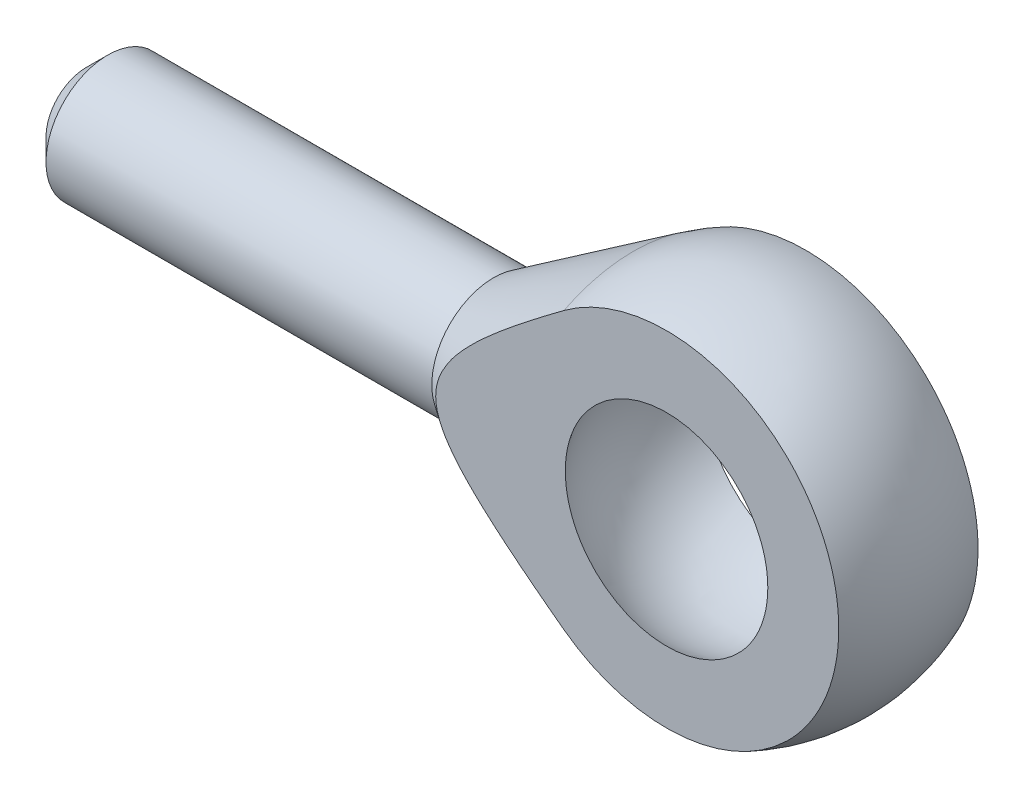
ISO-10303-21;
HEADER;
FILE_DESCRIPTION(('STEP AP214'),'2;1');
FILE_NAME('part.step','',(''),(''),'','','');
FILE_SCHEMA(('AUTOMOTIVE_DESIGN { 1 0 10303 214 1 1 1 1 }'));
ENDSEC;
DATA;
#1=APPLICATION_CONTEXT('core data for automotive mechanical design processes');
#2=APPLICATION_PROTOCOL_DEFINITION('international standard','automotive_design',2000,#1);
#3=PRODUCT_CONTEXT('',#1,'mechanical');
#4=PRODUCT('Part','Part','',(#3));
#5=PRODUCT_RELATED_PRODUCT_CATEGORY('part','',(#4));
#6=PRODUCT_DEFINITION_FORMATION('','',#4);
#7=PRODUCT_DEFINITION_CONTEXT('part definition',#1,'design');
#8=PRODUCT_DEFINITION('design','',#6,#7);
#9=PRODUCT_DEFINITION_SHAPE('','',#8);
#10=(LENGTH_UNIT() NAMED_UNIT(*) SI_UNIT(.MILLI.,.METRE.));
#11=(NAMED_UNIT(*) PLANE_ANGLE_UNIT() SI_UNIT($,.RADIAN.));
#12=(NAMED_UNIT(*) SI_UNIT($,.STERADIAN.) SOLID_ANGLE_UNIT());
#13=UNCERTAINTY_MEASURE_WITH_UNIT(LENGTH_MEASURE(1.E-05),#10,'distance_accuracy_value','');
#14=(GEOMETRIC_REPRESENTATION_CONTEXT(3) GLOBAL_UNCERTAINTY_ASSIGNED_CONTEXT((#13)) GLOBAL_UNIT_ASSIGNED_CONTEXT((#10,
#11,#12)) REPRESENTATION_CONTEXT('',''));
#15=CARTESIAN_POINT('',(0.,0.,0.));
#16=DIRECTION('',(0.,0.,1.));
#17=DIRECTION('',(1.,0.,0.));
#18=AXIS2_PLACEMENT_3D('',#15,#16,#17);
#19=CARTESIAN_POINT('',(42.,0.,0.));
#20=DIRECTION('',(-1.,0.,0.));
#21=DIRECTION('',(0.,0.,-1.));
#22=AXIS2_PLACEMENT_3D('',#19,#20,#21);
#23=CYLINDRICAL_SURFACE('',#22,4.);
#24=CARTESIAN_POINT('',(26.3284829694053,0.,0.));
#25=DIRECTION('',(1.,0.,0.));
#26=DIRECTION('',(0.,0.,-1.));
#27=AXIS2_PLACEMENT_3D('',#24,#25,#26);
#28=CIRCLE('',#27,4.);
#29=CARTESIAN_POINT('',(26.3284829694053,0.,-4.));
#30=VERTEX_POINT('',#29);
#31=EDGE_CURVE('E132',#30,#30,#28,.T.);
#32=ORIENTED_EDGE('',*,*,#31,.F.);
#33=EDGE_LOOP('',(#32));
#34=FACE_BOUND('',#33,.T.);
#35=CARTESIAN_POINT('',(1.4,0.,0.));
#36=DIRECTION('',(1.,0.,0.));
#37=DIRECTION('',(0.,0.,-1.));
#38=AXIS2_PLACEMENT_3D('',#35,#36,#37);
#39=CIRCLE('',#38,4.);
#40=CARTESIAN_POINT('',(1.4,0.,-4.));
#41=VERTEX_POINT('',#40);
#42=EDGE_CURVE('E119',#41,#41,#39,.T.);
#43=ORIENTED_EDGE('',*,*,#42,.T.);
#44=EDGE_LOOP('',(#43));
#45=FACE_BOUND('',#44,.T.);
#46=ADVANCED_FACE('F16',(#34,#45),#23,.T.);
#47=CARTESIAN_POINT('',(42.,0.,0.));
#48=DIRECTION('',(1.,0.,0.));
#49=DIRECTION('',(0.,-1.,0.));
#50=AXIS2_PLACEMENT_3D('',#47,#48,#49);
#51=SPHERICAL_SURFACE('',#50,7.93977329651169);
#52=CARTESIAN_POINT('',(42.,0.,-4.5));
#53=DIRECTION('',(0.,0.,-1.));
#54=DIRECTION('',(-1.,0.,0.));
#55=AXIS2_PLACEMENT_3D('',#52,#53,#54);
#56=CIRCLE('',#55,6.54140657657052);
#57=CARTESIAN_POINT('',(35.4585934234295,0.,-4.5));
#58=VERTEX_POINT('',#57);
#59=EDGE_CURVE('E11',#58,#58,#56,.T.);
#60=ORIENTED_EDGE('',*,*,#59,.T.);
#61=EDGE_LOOP('',(#60));
#62=FACE_BOUND('',#61,.T.);
#63=CARTESIAN_POINT('',(42.,0.,4.5));
#64=DIRECTION('',(0.,0.,1.));
#65=DIRECTION('',(1.,0.,0.));
#66=AXIS2_PLACEMENT_3D('',#63,#64,#65);
#67=CIRCLE('',#66,6.54140657657052);
#68=CARTESIAN_POINT('',(48.5414065765705,0.,4.5));
#69=VERTEX_POINT('',#68);
#70=EDGE_CURVE('E27',#69,#69,#67,.T.);
#71=ORIENTED_EDGE('',*,*,#70,.T.);
#72=EDGE_LOOP('',(#71));
#73=FACE_BOUND('',#72,.T.);
#74=CARTESIAN_POINT('',(34.0602267034883,0.,0.));
#75=VERTEX_POINT('',#74);
#76=VERTEX_LOOP('',#75);
#77=FACE_BOUND('',#76,.T.);
#78=CARTESIAN_POINT('',(49.9397732965117,0.,0.));
#79=VERTEX_POINT('',#78);
#80=VERTEX_LOOP('',#79);
#81=FACE_BOUND('',#80,.T.);
#82=ADVANCED_FACE('F88',(#62,#73,#77,#81),#51,.F.);
#83=CARTESIAN_POINT('',(25.,12.,-4.5));
#84=DIRECTION('',(0.,0.,-1.));
#85=DIRECTION('',(0.,-1.,0.));
#86=AXIS2_PLACEMENT_3D('',#83,#84,#85);
#87=PLANE('',#86);
#88=ORIENTED_EDGE('',*,*,#59,.F.);
#89=EDGE_LOOP('',(#88));
#90=FACE_BOUND('',#89,.T.);
#91=CARTESIAN_POINT('',(35.3631462414641,-8.927607304749,-4.5));
#92=CARTESIAN_POINT('',(34.2725780323723,-8.11687028749685,-4.5));
#93=CARTESIAN_POINT('',(33.3794905062705,-7.4233962561277,-4.5));
#94=CARTESIAN_POINT('',(31.661149025818,-6.08912032136065,-4.5));
#95=CARTESIAN_POINT('',(30.4951219555864,-5.05259746094315,-4.5));
#96=CARTESIAN_POINT('',(29.1060287883502,-3.8177832273387,-4.5));
#97=CARTESIAN_POINT('',(28.3231359830584,-2.84542671248182,-4.5));
#98=CARTESIAN_POINT('',(27.7684038930655,-2.15644686995566,-4.5));
#99=CARTESIAN_POINT('',(27.4676744116394,-1.540088283858,-4.5));
#100=CARTESIAN_POINT('',(27.0898392676771,-0.7656981774862,-4.5));
#101=CARTESIAN_POINT('',(27.0818428719071,-0.0319697078198997,-4.5));
#102=CARTESIAN_POINT('',(27.073781030168,0.70776391367402,-4.5));
#103=CARTESIAN_POINT('',(27.4426335216218,1.48795824968198,-4.5));
#104=CARTESIAN_POINT('',(27.7367334879418,2.11003654184327,-4.5));
#105=CARTESIAN_POINT('',(28.2924567616702,2.80713426499104,-4.5));
#106=CARTESIAN_POINT('',(29.073972764969,3.78746575776454,-4.5));
#107=CARTESIAN_POINT('',(30.477353213854,5.03679076294918,-4.5));
#108=CARTESIAN_POINT('',(31.5984475280382,6.03481746411454,-4.5));
#109=CARTESIAN_POINT('',(33.2327005713773,7.30917875337783,-4.5));
#110=CARTESIAN_POINT('',(34.1849800383903,8.05174924713813,-4.5));
#111=CARTESIAN_POINT('',(35.3631462414641,8.927607304749,-4.5));
#112=B_SPLINE_CURVE_WITH_KNOTS('',2,(#91,#92,#93,#94,#95,#96,#97,#98,#99,#100,#101,#102,#103,
#104,#105,#106,#107,#108,#109,#110,#111),.UNSPECIFIED.,.F.,.F.,(3,2,2,2,2,2,2,2,2,2,3),(0.,0.1,
0.25,0.375,0.4375,0.5,0.5625,0.625,0.75,0.892857142857143,1.),.UNSPECIFIED.);
#113=CARTESIAN_POINT('',(35.3631462414641,-8.92760730474899,-4.5));
#114=VERTEX_POINT('',#113);
#115=CARTESIAN_POINT('',(35.3631462414641,8.927607304749,-4.5));
#116=VERTEX_POINT('',#115);
#117=EDGE_CURVE('E170',#114,#116,#112,.T.);
#118=ORIENTED_EDGE('',*,*,#117,.T.);
#119=CARTESIAN_POINT('',(42.,0.,-4.5));
#120=DIRECTION('',(0.,0.,1.));
#121=DIRECTION('',(-1.,0.,0.));
#122=AXIS2_PLACEMENT_3D('',#119,#120,#121);
#123=CIRCLE('',#122,11.1242977306435);
#124=EDGE_CURVE('E122',#114,#116,#123,.T.);
#125=ORIENTED_EDGE('',*,*,#124,.F.);
#126=EDGE_LOOP('',(#118,#125));
#127=FACE_BOUND('',#126,.T.);
#128=ADVANCED_FACE('F91',(#90,#127),#87,.T.);
#129=CARTESIAN_POINT('',(54.,12.,4.5));
#130=DIRECTION('',(0.,0.,1.));
#131=DIRECTION('',(1.,0.,0.));
#132=AXIS2_PLACEMENT_3D('',#129,#130,#131);
#133=PLANE('',#132);
#134=ORIENTED_EDGE('',*,*,#70,.F.);
#135=EDGE_LOOP('',(#134));
#136=FACE_BOUND('',#135,.T.);
#137=CARTESIAN_POINT('',(35.3631462414641,8.927607304749,4.5));
#138=CARTESIAN_POINT('',(34.2687137332977,8.11399753705409,4.5));
#139=CARTESIAN_POINT('',(33.3734895612027,7.41874023124257,4.5));
#140=CARTESIAN_POINT('',(31.6463129607468,6.07736430851298,4.5));
#141=CARTESIAN_POINT('',(30.477353213854,5.03679076294918,4.5));
#142=CARTESIAN_POINT('',(29.0747620724235,3.78824542946423,4.5));
#143=CARTESIAN_POINT('',(28.2924567616702,2.80713426499104,4.5));
#144=CARTESIAN_POINT('',(27.7373451905238,2.11095318006953,4.5));
#145=CARTESIAN_POINT('',(27.4426335216218,1.48795824968198,4.5));
#146=CARTESIAN_POINT('',(27.0740548671705,0.7088149126442,4.5));
#147=CARTESIAN_POINT('',(27.081842871907,-0.0319697078198997,4.5));
#148=CARTESIAN_POINT('',(27.089545653413,-0.7646480082835,4.5));
#149=CARTESIAN_POINT('',(27.4676744116395,-1.540088283858,4.5));
#150=CARTESIAN_POINT('',(27.7677857979684,-2.15553593510118,4.5));
#151=CARTESIAN_POINT('',(28.3231359830584,-2.84542671248182,4.5));
#152=CARTESIAN_POINT('',(29.1052444646696,-3.8170108459909,4.5));
#153=CARTESIAN_POINT('',(30.4951219555864,-5.05259746094315,4.5));
#154=CARTESIAN_POINT('',(31.6133052155622,-6.04665073406905,4.5));
#155=CARTESIAN_POINT('',(33.2391408862806,-7.31419725097735,4.5));
#156=CARTESIAN_POINT('',(34.1891103171953,-8.05481972901245,4.5));
#157=CARTESIAN_POINT('',(35.3631462414641,-8.927607304749,4.5));
#158=B_SPLINE_CURVE_WITH_KNOTS('',2,(#137,#138,#139,#140,#141,#142,#143,#144,#145,#146,#147,
#148,#149,#150,#151,#152,#153,#154,#155,#156,#157),.UNSPECIFIED.,.F.,.F.,(3,2,2,2,2,2,2,2,2,2,
3),(0.,0.1,0.25,0.375,0.4375,0.5,0.5625,0.625,0.75,0.892857142857143,1.),.UNSPECIFIED.);
#159=CARTESIAN_POINT('',(35.3631462414641,8.927607304749,4.5));
#160=VERTEX_POINT('',#159);
#161=CARTESIAN_POINT('',(35.3631462414641,-8.92760730474899,4.5));
#162=VERTEX_POINT('',#161);
#163=EDGE_CURVE('E63',#160,#162,#158,.T.);
#164=ORIENTED_EDGE('',*,*,#163,.T.);
#165=CARTESIAN_POINT('',(42.,0.,4.5));
#166=DIRECTION('',(0.,0.,-1.));
#167=DIRECTION('',(1.,0.,0.));
#168=AXIS2_PLACEMENT_3D('',#165,#166,#167);
#169=CIRCLE('',#168,11.1242977306435);
#170=EDGE_CURVE('E148',#160,#162,#169,.T.);
#171=ORIENTED_EDGE('',*,*,#170,.F.);
#172=EDGE_LOOP('',(#164,#171));
#173=FACE_BOUND('',#172,.T.);
#174=ADVANCED_FACE('F98',(#136,#173),#133,.T.);
#175=CARTESIAN_POINT('',(26.3284829694053,0.,0.));
#176=DIRECTION('',(1.,0.,0.));
#177=DIRECTION('',(0.,0.,-1.));
#178=AXIS2_PLACEMENT_3D('',#175,#176,#177);
#179=CONICAL_SURFACE('',#178,4.,0.586046004341054);
#180=ORIENTED_EDGE('',*,*,#31,.T.);
#181=EDGE_LOOP('',(#180));
#182=FACE_BOUND('',#181,.T.);
#183=CARTESIAN_POINT('',(35.3631462414641,0.,0.));
#184=DIRECTION('',(1.,0.,0.));
#185=DIRECTION('',(0.,0.,-1.));
#186=AXIS2_PLACEMENT_3D('',#183,#184,#185);
#187=CIRCLE('',#186,9.99760832338453);
#188=EDGE_CURVE('E127',#116,#160,#187,.T.);
#189=ORIENTED_EDGE('',*,*,#188,.F.);
#190=ORIENTED_EDGE('',*,*,#117,.F.);
#191=CARTESIAN_POINT('',(35.3631462414641,0.,0.));
#192=DIRECTION('',(1.,0.,0.));
#193=DIRECTION('',(0.,0.,-1.));
#194=AXIS2_PLACEMENT_3D('',#191,#192,#193);
#195=CIRCLE('',#194,9.99760832338453);
#196=EDGE_CURVE('E186',#162,#114,#195,.T.);
#197=ORIENTED_EDGE('',*,*,#196,.F.);
#198=ORIENTED_EDGE('',*,*,#163,.F.);
#199=EDGE_LOOP('',(#189,#190,#197,#198));
#200=FACE_BOUND('',#199,.T.);
#201=ADVANCED_FACE('F110',(#182,#200),#179,.T.);
#202=CARTESIAN_POINT('',(42.,0.,0.));
#203=DIRECTION('',(1.,0.,0.));
#204=DIRECTION('',(0.,-1.,0.));
#205=AXIS2_PLACEMENT_3D('',#202,#203,#204);
#206=SPHERICAL_SURFACE('',#205,12.);
#207=CARTESIAN_POINT('',(54.,0.,0.));
#208=VERTEX_POINT('',#207);
#209=VERTEX_LOOP('',#208);
#210=FACE_BOUND('',#209,.T.);
#211=ORIENTED_EDGE('',*,*,#124,.T.);
#212=ORIENTED_EDGE('',*,*,#188,.T.);
#213=ORIENTED_EDGE('',*,*,#170,.T.);
#214=ORIENTED_EDGE('',*,*,#196,.T.);
#215=EDGE_LOOP('',(#211,#212,#213,#214));
#216=FACE_BOUND('',#215,.T.);
#217=ADVANCED_FACE('F107',(#210,#216),#206,.T.);
#218=CARTESIAN_POINT('',(0.,0.,0.));
#219=DIRECTION('',(1.,0.,0.));
#220=DIRECTION('',(0.,0.,-1.));
#221=AXIS2_PLACEMENT_3D('',#218,#219,#220);
#222=CONICAL_SURFACE('',#221,2.6,0.785398163397449);
#223=CARTESIAN_POINT('',(0.,0.,0.));
#224=DIRECTION('',(1.,0.,0.));
#225=DIRECTION('',(0.,0.,-1.));
#226=AXIS2_PLACEMENT_3D('',#223,#224,#225);
#227=CIRCLE('',#226,2.6);
#228=CARTESIAN_POINT('',(0.,0.,-2.6));
#229=VERTEX_POINT('',#228);
#230=EDGE_CURVE('E82',#229,#229,#227,.T.);
#231=ORIENTED_EDGE('',*,*,#230,.T.);
#232=EDGE_LOOP('',(#231));
#233=FACE_BOUND('',#232,.T.);
#234=ORIENTED_EDGE('',*,*,#42,.F.);
#235=EDGE_LOOP('',(#234));
#236=FACE_BOUND('',#235,.T.);
#237=ADVANCED_FACE('F109',(#233,#236),#222,.T.);
#238=CARTESIAN_POINT('',(0.,0.,0.));
#239=DIRECTION('',(1.,0.,0.));
#240=DIRECTION('',(0.,1.,0.));
#241=AXIS2_PLACEMENT_3D('',#238,#239,#240);
#242=PLANE('',#241);
#243=ORIENTED_EDGE('',*,*,#230,.F.);
#244=EDGE_LOOP('',(#243));
#245=FACE_BOUND('',#244,.T.);
#246=ADVANCED_FACE('F18',(#245),#242,.F.);
#247=CLOSED_SHELL('',(#46,#82,#128,#174,#201,#217,#237,#246));
#248=MANIFOLD_SOLID_BREP('B1',#247);
#249=ADVANCED_BREP_SHAPE_REPRESENTATION('',(#18,#248),#14);
#250=SHAPE_DEFINITION_REPRESENTATION(#9,#249);
ENDSEC;
END-ISO-10303-21;
